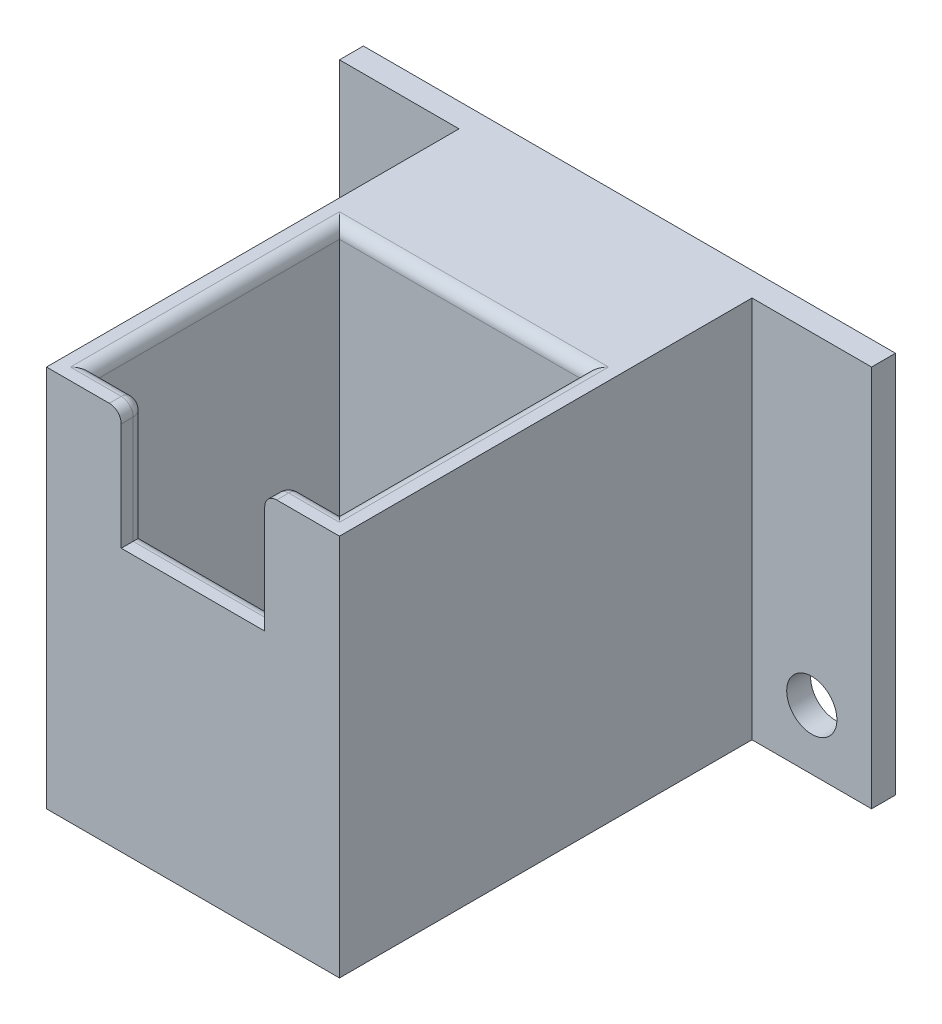
ISO-10303-21;
HEADER;
FILE_DESCRIPTION(('STEP AP214'),'2;1');
FILE_NAME('part.step','',(''),(''),'','','');
FILE_SCHEMA(('AUTOMOTIVE_DESIGN { 1 0 10303 214 1 1 1 1 }'));
ENDSEC;
DATA;
#1=APPLICATION_CONTEXT('core data for automotive mechanical design processes');
#2=APPLICATION_PROTOCOL_DEFINITION('international standard','automotive_design',2000,#1);
#3=PRODUCT_CONTEXT('',#1,'mechanical');
#4=PRODUCT('Part','Part','',(#3));
#5=PRODUCT_RELATED_PRODUCT_CATEGORY('part','',(#4));
#6=PRODUCT_DEFINITION_FORMATION('','',#4);
#7=PRODUCT_DEFINITION_CONTEXT('part definition',#1,'design');
#8=PRODUCT_DEFINITION('design','',#6,#7);
#9=PRODUCT_DEFINITION_SHAPE('','',#8);
#10=(LENGTH_UNIT() NAMED_UNIT(*) SI_UNIT(.MILLI.,.METRE.));
#11=(NAMED_UNIT(*) PLANE_ANGLE_UNIT() SI_UNIT($,.RADIAN.));
#12=(NAMED_UNIT(*) SI_UNIT($,.STERADIAN.) SOLID_ANGLE_UNIT());
#13=UNCERTAINTY_MEASURE_WITH_UNIT(LENGTH_MEASURE(1.E-05),#10,'distance_accuracy_value','');
#14=(GEOMETRIC_REPRESENTATION_CONTEXT(3) GLOBAL_UNCERTAINTY_ASSIGNED_CONTEXT((#13)) GLOBAL_UNIT_ASSIGNED_CONTEXT((#10,
#11,#12)) REPRESENTATION_CONTEXT('',''));
#15=CARTESIAN_POINT('',(0.,0.,0.));
#16=DIRECTION('',(0.,0.,1.));
#17=DIRECTION('',(1.,0.,0.));
#18=AXIS2_PLACEMENT_3D('',#15,#16,#17);
#19=CARTESIAN_POINT('',(2.,32.,-22.5));
#20=DIRECTION('',(1.,0.,0.));
#21=DIRECTION('',(0.,0.,-1.));
#22=AXIS2_PLACEMENT_3D('',#19,#20,#21);
#23=PLANE('',#22);
#24=DIRECTION('',(0.,-1.,0.));
#25=VECTOR('',#24,1.);
#26=CARTESIAN_POINT('',(2.,32.,-22.5));
#27=LINE('',#26,#25);
#28=CARTESIAN_POINT('',(2.,31.,-22.5));
#29=VERTEX_POINT('',#28);
#30=CARTESIAN_POINT('',(2.,2.,-22.5));
#31=VERTEX_POINT('',#30);
#32=EDGE_CURVE('E253',#29,#31,#27,.T.);
#33=ORIENTED_EDGE('',*,*,#32,.F.);
#34=DIRECTION('',(0.,0.,1.));
#35=VECTOR('',#34,1.);
#36=CARTESIAN_POINT('',(2.,31.,-22.5));
#37=LINE('',#36,#35);
#38=CARTESIAN_POINT('',(2.,31.,-2.));
#39=VERTEX_POINT('',#38);
#40=EDGE_CURVE('E358',#29,#39,#37,.T.);
#41=ORIENTED_EDGE('',*,*,#40,.T.);
#42=DIRECTION('',(0.,-1.,0.));
#43=VECTOR('',#42,1.);
#44=CARTESIAN_POINT('',(2.,32.,-2.));
#45=LINE('',#44,#43);
#46=CARTESIAN_POINT('',(2.,2.,-2.));
#47=VERTEX_POINT('',#46);
#48=EDGE_CURVE('E259',#39,#47,#45,.T.);
#49=ORIENTED_EDGE('',*,*,#48,.T.);
#50=DIRECTION('',(0.,0.,-1.));
#51=VECTOR('',#50,1.);
#52=CARTESIAN_POINT('',(2.,2.,-2.));
#53=LINE('',#52,#51);
#54=EDGE_CURVE('E239',#47,#31,#53,.T.);
#55=ORIENTED_EDGE('',*,*,#54,.T.);
#56=EDGE_LOOP('',(#33,#41,#49,#55));
#57=FACE_BOUND('',#56,.T.);
#58=ADVANCED_FACE('F33',(#57),#23,.T.);
#59=CARTESIAN_POINT('',(2.,32.,-2.));
#60=DIRECTION('',(0.,0.,-1.));
#61=DIRECTION('',(-1.,0.,0.));
#62=AXIS2_PLACEMENT_3D('',#59,#60,#61);
#63=PLANE('',#62);
#64=ORIENTED_EDGE('',*,*,#48,.F.);
#65=DIRECTION('',(1.,0.,0.));
#66=VECTOR('',#65,1.);
#67=CARTESIAN_POINT('',(2.,31.,-2.));
#68=LINE('',#67,#66);
#69=CARTESIAN_POINT('',(5.25,31.,-2.));
#70=VERTEX_POINT('',#69);
#71=EDGE_CURVE('E331',#39,#70,#68,.T.);
#72=ORIENTED_EDGE('',*,*,#71,.T.);
#73=DIRECTION('',(0.,1.,0.));
#74=VECTOR('',#73,1.);
#75=CARTESIAN_POINT('',(5.25,22.,-2.));
#76=LINE('',#75,#74);
#77=CARTESIAN_POINT('',(5.25,21.,-2.));
#78=VERTEX_POINT('',#77);
#79=EDGE_CURVE('E329',#70,#78,#76,.F.);
#80=ORIENTED_EDGE('',*,*,#79,.T.);
#81=DIRECTION('',(-1.,0.,0.));
#82=VECTOR('',#81,1.);
#83=CARTESIAN_POINT('',(2.,21.,-2.));
#84=LINE('',#83,#82);
#85=CARTESIAN_POINT('',(19.25,21.,-2.));
#86=VERTEX_POINT('',#85);
#87=EDGE_CURVE('E327',#78,#86,#84,.F.);
#88=ORIENTED_EDGE('',*,*,#87,.T.);
#89=DIRECTION('',(0.,1.,0.));
#90=VECTOR('',#89,1.);
#91=CARTESIAN_POINT('',(19.25,32.,-2.));
#92=LINE('',#91,#90);
#93=CARTESIAN_POINT('',(19.25,31.,-2.));
#94=VERTEX_POINT('',#93);
#95=EDGE_CURVE('E324',#86,#94,#92,.T.);
#96=ORIENTED_EDGE('',*,*,#95,.T.);
#97=DIRECTION('',(1.,0.,0.));
#98=VECTOR('',#97,1.);
#99=CARTESIAN_POINT('',(2.,31.,-2.));
#100=LINE('',#99,#98);
#101=CARTESIAN_POINT('',(22.5,31.,-2.));
#102=VERTEX_POINT('',#101);
#103=EDGE_CURVE('E322',#94,#102,#100,.T.);
#104=ORIENTED_EDGE('',*,*,#103,.T.);
#105=DIRECTION('',(0.,-1.,0.));
#106=VECTOR('',#105,1.);
#107=CARTESIAN_POINT('',(22.5,32.,-2.));
#108=LINE('',#107,#106);
#109=CARTESIAN_POINT('',(22.5,2.,-2.));
#110=VERTEX_POINT('',#109);
#111=EDGE_CURVE('E257',#102,#110,#108,.T.);
#112=ORIENTED_EDGE('',*,*,#111,.T.);
#113=DIRECTION('',(-1.,0.,0.));
#114=VECTOR('',#113,1.);
#115=CARTESIAN_POINT('',(2.,2.,-2.));
#116=LINE('',#115,#114);
#117=EDGE_CURVE('E250',#110,#47,#116,.T.);
#118=ORIENTED_EDGE('',*,*,#117,.T.);
#119=EDGE_LOOP('',(#64,#72,#80,#88,#96,#104,#112,#118));
#120=FACE_BOUND('',#119,.T.);
#121=ADVANCED_FACE('F480',(#120),#63,.T.);
#122=CARTESIAN_POINT('',(22.5,32.,-22.5));
#123=DIRECTION('',(-1.,0.,0.));
#124=DIRECTION('',(0.,0.,1.));
#125=AXIS2_PLACEMENT_3D('',#122,#123,#124);
#126=PLANE('',#125);
#127=ORIENTED_EDGE('',*,*,#111,.F.);
#128=DIRECTION('',(0.,0.,-1.));
#129=VECTOR('',#128,1.);
#130=CARTESIAN_POINT('',(22.5,31.,-22.5));
#131=LINE('',#130,#129);
#132=CARTESIAN_POINT('',(22.5,31.,-22.5));
#133=VERTEX_POINT('',#132);
#134=EDGE_CURVE('E58',#102,#133,#131,.T.);
#135=ORIENTED_EDGE('',*,*,#134,.T.);
#136=DIRECTION('',(0.,-1.,0.));
#137=VECTOR('',#136,1.);
#138=CARTESIAN_POINT('',(22.5,32.,-22.5));
#139=LINE('',#138,#137);
#140=CARTESIAN_POINT('',(22.5,2.,-22.5));
#141=VERTEX_POINT('',#140);
#142=EDGE_CURVE('E255',#133,#141,#139,.T.);
#143=ORIENTED_EDGE('',*,*,#142,.T.);
#144=DIRECTION('',(0.,0.,1.));
#145=VECTOR('',#144,1.);
#146=CARTESIAN_POINT('',(22.5,2.,-2.));
#147=LINE('',#146,#145);
#148=EDGE_CURVE('E247',#141,#110,#147,.T.);
#149=ORIENTED_EDGE('',*,*,#148,.T.);
#150=EDGE_LOOP('',(#127,#135,#143,#149));
#151=FACE_BOUND('',#150,.T.);
#152=ADVANCED_FACE('F509',(#151),#126,.T.);
#153=CARTESIAN_POINT('',(2.,32.,-22.5));
#154=DIRECTION('',(0.,0.,1.));
#155=DIRECTION('',(1.,0.,0.));
#156=AXIS2_PLACEMENT_3D('',#153,#154,#155);
#157=PLANE('',#156);
#158=ORIENTED_EDGE('',*,*,#142,.F.);
#159=DIRECTION('',(-1.,0.,0.));
#160=VECTOR('',#159,1.);
#161=CARTESIAN_POINT('',(2.,31.,-22.5));
#162=LINE('',#161,#160);
#163=EDGE_CURVE('E50',#133,#29,#162,.T.);
#164=ORIENTED_EDGE('',*,*,#163,.T.);
#165=ORIENTED_EDGE('',*,*,#32,.T.);
#166=DIRECTION('',(1.,0.,0.));
#167=VECTOR('',#166,1.);
#168=CARTESIAN_POINT('',(2.,2.,-22.5));
#169=LINE('',#168,#167);
#170=EDGE_CURVE('E244',#31,#141,#169,.T.);
#171=ORIENTED_EDGE('',*,*,#170,.T.);
#172=EDGE_LOOP('',(#158,#164,#165,#171));
#173=FACE_BOUND('',#172,.T.);
#174=ADVANCED_FACE('F514',(#173),#157,.T.);
#175=CARTESIAN_POINT('',(0.,32.,0.));
#176=DIRECTION('',(0.,1.,0.));
#177=DIRECTION('',(0.,0.,1.));
#178=AXIS2_PLACEMENT_3D('',#175,#176,#177);
#179=PLANE('',#178);
#180=DIRECTION('',(1.,0.,0.));
#181=VECTOR('',#180,1.);
#182=CARTESIAN_POINT('',(0.,32.,-1.));
#183=LINE('',#182,#181);
#184=CARTESIAN_POINT('',(23.5,32.,-1.));
#185=VERTEX_POINT('',#184);
#186=CARTESIAN_POINT('',(19.25,32.,-1.));
#187=VERTEX_POINT('',#186);
#188=EDGE_CURVE('E352',#185,#187,#183,.F.);
#189=ORIENTED_EDGE('',*,*,#188,.T.);
#190=DIRECTION('',(0.,0.,-1.));
#191=VECTOR('',#190,1.);
#192=CARTESIAN_POINT('',(19.25,32.,0.));
#193=LINE('',#192,#191);
#194=CARTESIAN_POINT('',(19.25,32.,0.));
#195=VERTEX_POINT('',#194);
#196=EDGE_CURVE('E354',#187,#195,#193,.F.);
#197=ORIENTED_EDGE('',*,*,#196,.T.);
#198=DIRECTION('',(1.,0.,0.));
#199=VECTOR('',#198,1.);
#200=CARTESIAN_POINT('',(0.,32.,0.));
#201=LINE('',#200,#199);
#202=CARTESIAN_POINT('',(24.5,32.,0.));
#203=VERTEX_POINT('',#202);
#204=EDGE_CURVE('E265',#195,#203,#201,.T.);
#205=ORIENTED_EDGE('',*,*,#204,.T.);
#206=DIRECTION('',(0.,0.,-1.));
#207=VECTOR('',#206,1.);
#208=CARTESIAN_POINT('',(24.5,32.,0.));
#209=LINE('',#208,#207);
#210=CARTESIAN_POINT('',(24.5,32.,-34.5));
#211=VERTEX_POINT('',#210);
#212=EDGE_CURVE('E270',#203,#211,#209,.T.);
#213=ORIENTED_EDGE('',*,*,#212,.T.);
#214=DIRECTION('',(1.,0.,0.));
#215=VECTOR('',#214,1.);
#216=CARTESIAN_POINT('',(24.5,32.,-34.5));
#217=LINE('',#216,#215);
#218=CARTESIAN_POINT('',(34.5,32.,-34.5));
#219=VERTEX_POINT('',#218);
#220=EDGE_CURVE('E272',#211,#219,#217,.T.);
#221=ORIENTED_EDGE('',*,*,#220,.T.);
#222=DIRECTION('',(0.,0.,-1.));
#223=VECTOR('',#222,1.);
#224=CARTESIAN_POINT('',(34.5,32.,-36.5));
#225=LINE('',#224,#223);
#226=CARTESIAN_POINT('',(34.5,32.,-36.5));
#227=VERTEX_POINT('',#226);
#228=EDGE_CURVE('E274',#219,#227,#225,.T.);
#229=ORIENTED_EDGE('',*,*,#228,.T.);
#230=DIRECTION('',(-1.,0.,0.));
#231=VECTOR('',#230,1.);
#232=CARTESIAN_POINT('',(24.5,32.,-36.5));
#233=LINE('',#232,#231);
#234=CARTESIAN_POINT('',(-10.,32.,-36.5));
#235=VERTEX_POINT('',#234);
#236=EDGE_CURVE('E276',#227,#235,#233,.T.);
#237=ORIENTED_EDGE('',*,*,#236,.T.);
#238=DIRECTION('',(0.,0.,1.));
#239=VECTOR('',#238,1.);
#240=CARTESIAN_POINT('',(-10.,32.,-36.5));
#241=LINE('',#240,#239);
#242=CARTESIAN_POINT('',(-10.,32.,-34.5));
#243=VERTEX_POINT('',#242);
#244=EDGE_CURVE('E278',#235,#243,#241,.T.);
#245=ORIENTED_EDGE('',*,*,#244,.T.);
#246=DIRECTION('',(1.,0.,0.));
#247=VECTOR('',#246,1.);
#248=CARTESIAN_POINT('',(0.,32.,-34.5));
#249=LINE('',#248,#247);
#250=CARTESIAN_POINT('',(0.,32.,-34.5));
#251=VERTEX_POINT('',#250);
#252=EDGE_CURVE('E280',#243,#251,#249,.T.);
#253=ORIENTED_EDGE('',*,*,#252,.T.);
#254=DIRECTION('',(0.,0.,1.));
#255=VECTOR('',#254,1.);
#256=CARTESIAN_POINT('',(0.,32.,0.));
#257=LINE('',#256,#255);
#258=CARTESIAN_POINT('',(0.,32.,0.));
#259=VERTEX_POINT('',#258);
#260=EDGE_CURVE('E262',#251,#259,#257,.T.);
#261=ORIENTED_EDGE('',*,*,#260,.T.);
#262=CARTESIAN_POINT('',(5.25,32.,0.));
#263=VERTEX_POINT('',#262);
#264=EDGE_CURVE('E267',#259,#263,#201,.T.);
#265=ORIENTED_EDGE('',*,*,#264,.T.);
#266=DIRECTION('',(0.,0.,1.));
#267=VECTOR('',#266,1.);
#268=CARTESIAN_POINT('',(5.25,32.,-2.));
#269=LINE('',#268,#267);
#270=CARTESIAN_POINT('',(5.25,32.,-1.));
#271=VERTEX_POINT('',#270);
#272=EDGE_CURVE('E342',#263,#271,#269,.F.);
#273=ORIENTED_EDGE('',*,*,#272,.T.);
#274=DIRECTION('',(1.,0.,0.));
#275=VECTOR('',#274,1.);
#276=CARTESIAN_POINT('',(0.,32.,-1.));
#277=LINE('',#276,#275);
#278=CARTESIAN_POINT('',(1.,32.,-1.));
#279=VERTEX_POINT('',#278);
#280=EDGE_CURVE('E344',#271,#279,#277,.F.);
#281=ORIENTED_EDGE('',*,*,#280,.T.);
#282=DIRECTION('',(0.,0.,1.));
#283=VECTOR('',#282,1.);
#284=CARTESIAN_POINT('',(1.,32.,0.));
#285=LINE('',#284,#283);
#286=CARTESIAN_POINT('',(0.999999999999999,32.,-23.5));
#287=VERTEX_POINT('',#286);
#288=EDGE_CURVE('E346',#279,#287,#285,.F.);
#289=ORIENTED_EDGE('',*,*,#288,.T.);
#290=DIRECTION('',(-1.,0.,0.));
#291=VECTOR('',#290,1.);
#292=CARTESIAN_POINT('',(0.,32.,-23.5));
#293=LINE('',#292,#291);
#294=CARTESIAN_POINT('',(23.5,32.,-23.5));
#295=VERTEX_POINT('',#294);
#296=EDGE_CURVE('E348',#287,#295,#293,.F.);
#297=ORIENTED_EDGE('',*,*,#296,.T.);
#298=DIRECTION('',(0.,0.,-1.));
#299=VECTOR('',#298,1.);
#300=CARTESIAN_POINT('',(23.5,32.,0.));
#301=LINE('',#300,#299);
#302=EDGE_CURVE('E350',#295,#185,#301,.F.);
#303=ORIENTED_EDGE('',*,*,#302,.T.);
#304=EDGE_LOOP('',(#189,#197,#205,#213,#221,#229,#237,#245,#253,#261,#265,#273,#281,#289,#297,#303));
#305=FACE_BOUND('',#304,.T.);
#306=ADVANCED_FACE('F446',(#305),#179,.T.);
#307=CARTESIAN_POINT('',(0.,0.,0.));
#308=DIRECTION('',(0.,1.,0.));
#309=DIRECTION('',(0.,0.,1.));
#310=AXIS2_PLACEMENT_3D('',#307,#308,#309);
#311=PLANE('',#310);
#312=DIRECTION('',(0.,0.,1.));
#313=VECTOR('',#312,1.);
#314=CARTESIAN_POINT('',(0.,0.,0.));
#315=LINE('',#314,#313);
#316=CARTESIAN_POINT('',(0.,0.,-34.5));
#317=VERTEX_POINT('',#316);
#318=CARTESIAN_POINT('',(0.,0.,0.));
#319=VERTEX_POINT('',#318);
#320=EDGE_CURVE('E261',#317,#319,#315,.T.);
#321=ORIENTED_EDGE('',*,*,#320,.F.);
#322=DIRECTION('',(1.,0.,0.));
#323=VECTOR('',#322,1.);
#324=CARTESIAN_POINT('',(0.,0.,-34.5));
#325=LINE('',#324,#323);
#326=CARTESIAN_POINT('',(-10.,0.,-34.5));
#327=VERTEX_POINT('',#326);
#328=EDGE_CURVE('E266',#327,#317,#325,.T.);
#329=ORIENTED_EDGE('',*,*,#328,.F.);
#330=DIRECTION('',(0.,0.,1.));
#331=VECTOR('',#330,1.);
#332=CARTESIAN_POINT('',(-10.,0.,-36.5));
#333=LINE('',#332,#331);
#334=CARTESIAN_POINT('',(-10.,0.,-36.5));
#335=VERTEX_POINT('',#334);
#336=EDGE_CURVE('E296',#335,#327,#333,.T.);
#337=ORIENTED_EDGE('',*,*,#336,.F.);
#338=DIRECTION('',(-1.,0.,0.));
#339=VECTOR('',#338,1.);
#340=CARTESIAN_POINT('',(0.,0.,-36.5));
#341=LINE('',#340,#339);
#342=CARTESIAN_POINT('',(34.5,0.,-36.5));
#343=VERTEX_POINT('',#342);
#344=EDGE_CURVE('E294',#343,#335,#341,.T.);
#345=ORIENTED_EDGE('',*,*,#344,.F.);
#346=DIRECTION('',(0.,0.,-1.));
#347=VECTOR('',#346,1.);
#348=CARTESIAN_POINT('',(34.5,0.,-36.5));
#349=LINE('',#348,#347);
#350=CARTESIAN_POINT('',(34.5,0.,-34.5));
#351=VERTEX_POINT('',#350);
#352=EDGE_CURVE('E291',#351,#343,#349,.T.);
#353=ORIENTED_EDGE('',*,*,#352,.F.);
#354=DIRECTION('',(1.,0.,0.));
#355=VECTOR('',#354,1.);
#356=CARTESIAN_POINT('',(24.5,0.,-34.5));
#357=LINE('',#356,#355);
#358=CARTESIAN_POINT('',(24.5,0.,-34.5));
#359=VERTEX_POINT('',#358);
#360=EDGE_CURVE('E289',#359,#351,#357,.T.);
#361=ORIENTED_EDGE('',*,*,#360,.F.);
#362=DIRECTION('',(0.,0.,-1.));
#363=VECTOR('',#362,1.);
#364=CARTESIAN_POINT('',(24.5,0.,0.));
#365=LINE('',#364,#363);
#366=CARTESIAN_POINT('',(24.5,0.,0.));
#367=VERTEX_POINT('',#366);
#368=EDGE_CURVE('E287',#367,#359,#365,.T.);
#369=ORIENTED_EDGE('',*,*,#368,.F.);
#370=DIRECTION('',(1.,0.,0.));
#371=VECTOR('',#370,1.);
#372=CARTESIAN_POINT('',(0.,0.,0.));
#373=LINE('',#372,#371);
#374=EDGE_CURVE('E285',#319,#367,#373,.T.);
#375=ORIENTED_EDGE('',*,*,#374,.F.);
#376=EDGE_LOOP('',(#321,#329,#337,#345,#353,#361,#369,#375));
#377=FACE_BOUND('',#376,.T.);
#378=CARTESIAN_POINT('',(3.50000000000016,0.,-20.9999999999999));
#379=DIRECTION('',(0.,-1.,0.));
#380=DIRECTION('',(0.,0.,-1.));
#381=AXIS2_PLACEMENT_3D('',#378,#379,#380);
#382=CIRCLE('',#381,1.25);
#383=CARTESIAN_POINT('',(3.50000000000016,0.,-22.2499999999999));
#384=VERTEX_POINT('',#383);
#385=EDGE_CURVE('E208',#384,#384,#382,.T.);
#386=ORIENTED_EDGE('',*,*,#385,.F.);
#387=EDGE_LOOP('',(#386));
#388=FACE_BOUND('',#387,.T.);
#389=CARTESIAN_POINT('',(21.0000000000002,0.,-20.9999999999998));
#390=DIRECTION('',(0.,-1.,0.));
#391=DIRECTION('',(0.,0.,-1.));
#392=AXIS2_PLACEMENT_3D('',#389,#390,#391);
#393=CIRCLE('',#392,1.25);
#394=CARTESIAN_POINT('',(21.0000000000002,0.,-22.2499999999998));
#395=VERTEX_POINT('',#394);
#396=EDGE_CURVE('E216',#395,#395,#393,.T.);
#397=ORIENTED_EDGE('',*,*,#396,.F.);
#398=EDGE_LOOP('',(#397));
#399=FACE_BOUND('',#398,.T.);
#400=CARTESIAN_POINT('',(21.,0.,-3.49999999999979));
#401=DIRECTION('',(0.,-1.,0.));
#402=DIRECTION('',(0.,0.,-1.));
#403=AXIS2_PLACEMENT_3D('',#400,#401,#402);
#404=CIRCLE('',#403,1.25);
#405=CARTESIAN_POINT('',(21.,0.,-4.74999999999979));
#406=VERTEX_POINT('',#405);
#407=EDGE_CURVE('E221',#406,#406,#404,.T.);
#408=ORIENTED_EDGE('',*,*,#407,.F.);
#409=EDGE_LOOP('',(#408));
#410=FACE_BOUND('',#409,.T.);
#411=CARTESIAN_POINT('',(3.5,0.,-3.5));
#412=DIRECTION('',(0.,-1.,0.));
#413=DIRECTION('',(0.,0.,-1.));
#414=AXIS2_PLACEMENT_3D('',#411,#412,#413);
#415=CIRCLE('',#414,1.25);
#416=CARTESIAN_POINT('',(3.5,0.,-4.75));
#417=VERTEX_POINT('',#416);
#418=EDGE_CURVE('E227',#417,#417,#415,.T.);
#419=ORIENTED_EDGE('',*,*,#418,.F.);
#420=EDGE_LOOP('',(#419));
#421=FACE_BOUND('',#420,.T.);
#422=CARTESIAN_POINT('',(12.25,0.,-12.25));
#423=DIRECTION('',(0.,-1.,0.));
#424=DIRECTION('',(0.,0.,-1.));
#425=AXIS2_PLACEMENT_3D('',#422,#423,#424);
#426=CIRCLE('',#425,8.);
#427=CARTESIAN_POINT('',(12.25,0.,-20.25));
#428=VERTEX_POINT('',#427);
#429=EDGE_CURVE('E233',#428,#428,#426,.T.);
#430=ORIENTED_EDGE('',*,*,#429,.F.);
#431=EDGE_LOOP('',(#430));
#432=FACE_BOUND('',#431,.T.);
#433=ADVANCED_FACE('F435',(#377,#388,#399,#410,#421,#432),#311,.F.);
#434=CARTESIAN_POINT('',(0.,32.,0.));
#435=DIRECTION('',(1.,0.,0.));
#436=DIRECTION('',(0.,0.,-1.));
#437=AXIS2_PLACEMENT_3D('',#434,#435,#436);
#438=PLANE('',#437);
#439=ORIENTED_EDGE('',*,*,#320,.T.);
#440=DIRECTION('',(0.,-1.,0.));
#441=VECTOR('',#440,1.);
#442=CARTESIAN_POINT('',(0.,32.,0.));
#443=LINE('',#442,#441);
#444=EDGE_CURVE('E319',#259,#319,#443,.T.);
#445=ORIENTED_EDGE('',*,*,#444,.F.);
#446=ORIENTED_EDGE('',*,*,#260,.F.);
#447=DIRECTION('',(0.,-1.,0.));
#448=VECTOR('',#447,1.);
#449=CARTESIAN_POINT('',(0.,32.,-34.5));
#450=LINE('',#449,#448);
#451=EDGE_CURVE('E282',#251,#317,#450,.T.);
#452=ORIENTED_EDGE('',*,*,#451,.T.);
#453=EDGE_LOOP('',(#439,#445,#446,#452));
#454=FACE_BOUND('',#453,.T.);
#455=ADVANCED_FACE('F443',(#454),#438,.F.);
#456=CARTESIAN_POINT('',(0.,32.,0.));
#457=DIRECTION('',(0.,0.,-1.));
#458=DIRECTION('',(-1.,0.,0.));
#459=AXIS2_PLACEMENT_3D('',#456,#457,#458);
#460=PLANE('',#459);
#461=ORIENTED_EDGE('',*,*,#204,.F.);
#462=CARTESIAN_POINT('',(19.25,31.,0.));
#463=DIRECTION('',(0.,0.,-1.));
#464=DIRECTION('',(-1.,0.,0.));
#465=AXIS2_PLACEMENT_3D('',#462,#463,#464);
#466=CIRCLE('',#465,1.);
#467=CARTESIAN_POINT('',(18.25,31.,0.));
#468=VERTEX_POINT('',#467);
#469=EDGE_CURVE('E11',#195,#468,#466,.F.);
#470=ORIENTED_EDGE('',*,*,#469,.T.);
#471=DIRECTION('',(0.,1.,0.));
#472=VECTOR('',#471,1.);
#473=CARTESIAN_POINT('',(18.25,22.,0.));
#474=LINE('',#473,#472);
#475=CARTESIAN_POINT('',(18.25,22.,0.));
#476=VERTEX_POINT('',#475);
#477=EDGE_CURVE('E189',#476,#468,#474,.T.);
#478=ORIENTED_EDGE('',*,*,#477,.F.);
#479=DIRECTION('',(1.,0.,0.));
#480=VECTOR('',#479,1.);
#481=CARTESIAN_POINT('',(6.25,22.,0.));
#482=LINE('',#481,#480);
#483=CARTESIAN_POINT('',(6.25,22.,0.));
#484=VERTEX_POINT('',#483);
#485=EDGE_CURVE('E195',#484,#476,#482,.T.);
#486=ORIENTED_EDGE('',*,*,#485,.F.);
#487=DIRECTION('',(0.,1.,0.));
#488=VECTOR('',#487,1.);
#489=CARTESIAN_POINT('',(6.25,22.,0.));
#490=LINE('',#489,#488);
#491=CARTESIAN_POINT('',(6.25,31.,0.));
#492=VERTEX_POINT('',#491);
#493=EDGE_CURVE('E194',#484,#492,#490,.T.);
#494=ORIENTED_EDGE('',*,*,#493,.T.);
#495=CARTESIAN_POINT('',(5.25,31.,0.));
#496=DIRECTION('',(0.,0.,-1.));
#497=DIRECTION('',(-1.,0.,0.));
#498=AXIS2_PLACEMENT_3D('',#495,#496,#497);
#499=CIRCLE('',#498,1.);
#500=EDGE_CURVE('E42',#492,#263,#499,.F.);
#501=ORIENTED_EDGE('',*,*,#500,.T.);
#502=ORIENTED_EDGE('',*,*,#264,.F.);
#503=ORIENTED_EDGE('',*,*,#444,.T.);
#504=ORIENTED_EDGE('',*,*,#374,.T.);
#505=DIRECTION('',(0.,-1.,0.));
#506=VECTOR('',#505,1.);
#507=CARTESIAN_POINT('',(24.5,32.,0.));
#508=LINE('',#507,#506);
#509=EDGE_CURVE('E316',#203,#367,#508,.T.);
#510=ORIENTED_EDGE('',*,*,#509,.F.);
#511=EDGE_LOOP('',(#461,#470,#478,#486,#494,#501,#502,#503,#504,#510));
#512=FACE_BOUND('',#511,.T.);
#513=ADVANCED_FACE('F206',(#512),#460,.F.);
#514=CARTESIAN_POINT('',(24.5,32.,0.));
#515=DIRECTION('',(-1.,0.,0.));
#516=DIRECTION('',(0.,0.,1.));
#517=AXIS2_PLACEMENT_3D('',#514,#515,#516);
#518=PLANE('',#517);
#519=ORIENTED_EDGE('',*,*,#368,.T.);
#520=DIRECTION('',(0.,-1.,0.));
#521=VECTOR('',#520,1.);
#522=CARTESIAN_POINT('',(24.5,32.,-34.5));
#523=LINE('',#522,#521);
#524=EDGE_CURVE('E313',#211,#359,#523,.T.);
#525=ORIENTED_EDGE('',*,*,#524,.F.);
#526=ORIENTED_EDGE('',*,*,#212,.F.);
#527=ORIENTED_EDGE('',*,*,#509,.T.);
#528=EDGE_LOOP('',(#519,#525,#526,#527));
#529=FACE_BOUND('',#528,.T.);
#530=ADVANCED_FACE('F459',(#529),#518,.F.);
#531=CARTESIAN_POINT('',(24.5,32.,-34.5));
#532=DIRECTION('',(0.,0.,-1.));
#533=DIRECTION('',(-1.,0.,0.));
#534=AXIS2_PLACEMENT_3D('',#531,#532,#533);
#535=PLANE('',#534);
#536=CARTESIAN_POINT('',(29.5,5.,-34.5));
#537=DIRECTION('',(0.,0.,-1.));
#538=DIRECTION('',(-1.,0.,0.));
#539=AXIS2_PLACEMENT_3D('',#536,#537,#538);
#540=CIRCLE('',#539,2.1);
#541=CARTESIAN_POINT('',(27.4,5.,-34.5));
#542=VERTEX_POINT('',#541);
#543=EDGE_CURVE('E364',#542,#542,#540,.F.);
#544=ORIENTED_EDGE('',*,*,#543,.F.);
#545=EDGE_LOOP('',(#544));
#546=FACE_BOUND('',#545,.T.);
#547=ORIENTED_EDGE('',*,*,#360,.T.);
#548=DIRECTION('',(0.,-1.,0.));
#549=VECTOR('',#548,1.);
#550=CARTESIAN_POINT('',(34.5,32.,-34.5));
#551=LINE('',#550,#549);
#552=EDGE_CURVE('E310',#219,#351,#551,.T.);
#553=ORIENTED_EDGE('',*,*,#552,.F.);
#554=ORIENTED_EDGE('',*,*,#220,.F.);
#555=ORIENTED_EDGE('',*,*,#524,.T.);
#556=EDGE_LOOP('',(#547,#553,#554,#555));
#557=FACE_BOUND('',#556,.T.);
#558=ADVANCED_FACE('F455',(#546,#557),#535,.F.);
#559=CARTESIAN_POINT('',(34.5,32.,-36.5));
#560=DIRECTION('',(-1.,0.,0.));
#561=DIRECTION('',(0.,0.,1.));
#562=AXIS2_PLACEMENT_3D('',#559,#560,#561);
#563=PLANE('',#562);
#564=ORIENTED_EDGE('',*,*,#352,.T.);
#565=DIRECTION('',(0.,-1.,0.));
#566=VECTOR('',#565,1.);
#567=CARTESIAN_POINT('',(34.5,32.,-36.5));
#568=LINE('',#567,#566);
#569=EDGE_CURVE('E307',#227,#343,#568,.T.);
#570=ORIENTED_EDGE('',*,*,#569,.F.);
#571=ORIENTED_EDGE('',*,*,#228,.F.);
#572=ORIENTED_EDGE('',*,*,#552,.T.);
#573=EDGE_LOOP('',(#564,#570,#571,#572));
#574=FACE_BOUND('',#573,.T.);
#575=ADVANCED_FACE('F420',(#574),#563,.F.);
#576=CARTESIAN_POINT('',(0.,32.,-36.5));
#577=DIRECTION('',(0.,0.,1.));
#578=DIRECTION('',(1.,0.,0.));
#579=AXIS2_PLACEMENT_3D('',#576,#577,#578);
#580=PLANE('',#579);
#581=CARTESIAN_POINT('',(29.5,5.,-36.5));
#582=DIRECTION('',(0.,0.,-1.));
#583=DIRECTION('',(-1.,0.,0.));
#584=AXIS2_PLACEMENT_3D('',#581,#582,#583);
#585=CIRCLE('',#584,2.1);
#586=CARTESIAN_POINT('',(27.4,5.,-36.5));
#587=VERTEX_POINT('',#586);
#588=EDGE_CURVE('E404',#587,#587,#585,.T.);
#589=ORIENTED_EDGE('',*,*,#588,.F.);
#590=EDGE_LOOP('',(#589));
#591=FACE_BOUND('',#590,.T.);
#592=CARTESIAN_POINT('',(-5.,5.,-36.5));
#593=DIRECTION('',(0.,0.,-1.));
#594=DIRECTION('',(1.,0.,0.));
#595=AXIS2_PLACEMENT_3D('',#592,#593,#594);
#596=CIRCLE('',#595,2.1);
#597=CARTESIAN_POINT('',(-2.9,5.,-36.5));
#598=VERTEX_POINT('',#597);
#599=EDGE_CURVE('E405',#598,#598,#596,.T.);
#600=ORIENTED_EDGE('',*,*,#599,.F.);
#601=EDGE_LOOP('',(#600));
#602=FACE_BOUND('',#601,.T.);
#603=ORIENTED_EDGE('',*,*,#344,.T.);
#604=DIRECTION('',(0.,-1.,0.));
#605=VECTOR('',#604,1.);
#606=CARTESIAN_POINT('',(-10.,32.,-36.5));
#607=LINE('',#606,#605);
#608=EDGE_CURVE('E304',#235,#335,#607,.T.);
#609=ORIENTED_EDGE('',*,*,#608,.F.);
#610=ORIENTED_EDGE('',*,*,#236,.F.);
#611=ORIENTED_EDGE('',*,*,#569,.T.);
#612=EDGE_LOOP('',(#603,#609,#610,#611));
#613=FACE_BOUND('',#612,.T.);
#614=ADVANCED_FACE('F416',(#591,#602,#613),#580,.F.);
#615=CARTESIAN_POINT('',(-10.,32.,-36.5));
#616=DIRECTION('',(1.,0.,0.));
#617=DIRECTION('',(0.,0.,-1.));
#618=AXIS2_PLACEMENT_3D('',#615,#616,#617);
#619=PLANE('',#618);
#620=ORIENTED_EDGE('',*,*,#336,.T.);
#621=DIRECTION('',(0.,-1.,0.));
#622=VECTOR('',#621,1.);
#623=CARTESIAN_POINT('',(-10.,32.,-34.5));
#624=LINE('',#623,#622);
#625=EDGE_CURVE('E301',#243,#327,#624,.T.);
#626=ORIENTED_EDGE('',*,*,#625,.F.);
#627=ORIENTED_EDGE('',*,*,#244,.F.);
#628=ORIENTED_EDGE('',*,*,#608,.T.);
#629=EDGE_LOOP('',(#620,#626,#627,#628));
#630=FACE_BOUND('',#629,.T.);
#631=ADVANCED_FACE('F419',(#630),#619,.F.);
#632=CARTESIAN_POINT('',(0.,32.,-34.5));
#633=DIRECTION('',(0.,0.,-1.));
#634=DIRECTION('',(-1.,0.,0.));
#635=AXIS2_PLACEMENT_3D('',#632,#633,#634);
#636=PLANE('',#635);
#637=CARTESIAN_POINT('',(-5.,5.,-34.5));
#638=DIRECTION('',(0.,0.,-1.));
#639=DIRECTION('',(-1.,0.,0.));
#640=AXIS2_PLACEMENT_3D('',#637,#638,#639);
#641=CIRCLE('',#640,2.1);
#642=CARTESIAN_POINT('',(-7.1,5.,-34.5));
#643=VERTEX_POINT('',#642);
#644=EDGE_CURVE('E401',#643,#643,#641,.F.);
#645=ORIENTED_EDGE('',*,*,#644,.F.);
#646=EDGE_LOOP('',(#645));
#647=FACE_BOUND('',#646,.T.);
#648=ORIENTED_EDGE('',*,*,#328,.T.);
#649=ORIENTED_EDGE('',*,*,#451,.F.);
#650=ORIENTED_EDGE('',*,*,#252,.F.);
#651=ORIENTED_EDGE('',*,*,#625,.T.);
#652=EDGE_LOOP('',(#648,#649,#650,#651));
#653=FACE_BOUND('',#652,.T.);
#654=ADVANCED_FACE('F439',(#647,#653),#636,.F.);
#655=CARTESIAN_POINT('',(0.,2.,0.));
#656=DIRECTION('',(0.,-1.,0.));
#657=DIRECTION('',(0.,0.,-1.));
#658=AXIS2_PLACEMENT_3D('',#655,#656,#657);
#659=PLANE('',#658);
#660=CARTESIAN_POINT('',(3.50000000000016,2.,-20.9999999999999));
#661=DIRECTION('',(0.,-1.,0.));
#662=DIRECTION('',(0.,0.,-1.));
#663=AXIS2_PLACEMENT_3D('',#660,#661,#662);
#664=CIRCLE('',#663,1.25);
#665=CARTESIAN_POINT('',(3.50000000000016,2.,-22.2499999999999));
#666=VERTEX_POINT('',#665);
#667=EDGE_CURVE('E211',#666,#666,#664,.T.);
#668=ORIENTED_EDGE('',*,*,#667,.T.);
#669=EDGE_LOOP('',(#668));
#670=FACE_BOUND('',#669,.T.);
#671=CARTESIAN_POINT('',(21.0000000000002,2.,-20.9999999999998));
#672=DIRECTION('',(0.,-1.,0.));
#673=DIRECTION('',(0.,0.,-1.));
#674=AXIS2_PLACEMENT_3D('',#671,#672,#673);
#675=CIRCLE('',#674,1.25);
#676=CARTESIAN_POINT('',(21.0000000000002,2.,-22.2499999999998));
#677=VERTEX_POINT('',#676);
#678=EDGE_CURVE('E218',#677,#677,#675,.T.);
#679=ORIENTED_EDGE('',*,*,#678,.T.);
#680=EDGE_LOOP('',(#679));
#681=FACE_BOUND('',#680,.T.);
#682=CARTESIAN_POINT('',(21.,2.,-3.49999999999979));
#683=DIRECTION('',(0.,-1.,0.));
#684=DIRECTION('',(0.,0.,-1.));
#685=AXIS2_PLACEMENT_3D('',#682,#683,#684);
#686=CIRCLE('',#685,1.25);
#687=CARTESIAN_POINT('',(21.,2.,-4.74999999999979));
#688=VERTEX_POINT('',#687);
#689=EDGE_CURVE('E224',#688,#688,#686,.T.);
#690=ORIENTED_EDGE('',*,*,#689,.T.);
#691=EDGE_LOOP('',(#690));
#692=FACE_BOUND('',#691,.T.);
#693=CARTESIAN_POINT('',(3.5,2.,-3.5));
#694=DIRECTION('',(0.,-1.,0.));
#695=DIRECTION('',(0.,0.,-1.));
#696=AXIS2_PLACEMENT_3D('',#693,#694,#695);
#697=CIRCLE('',#696,1.25);
#698=CARTESIAN_POINT('',(3.5,2.,-4.75));
#699=VERTEX_POINT('',#698);
#700=EDGE_CURVE('E230',#699,#699,#697,.T.);
#701=ORIENTED_EDGE('',*,*,#700,.T.);
#702=EDGE_LOOP('',(#701));
#703=FACE_BOUND('',#702,.T.);
#704=CARTESIAN_POINT('',(12.25,2.,-12.25));
#705=DIRECTION('',(0.,-1.,0.));
#706=DIRECTION('',(0.,0.,-1.));
#707=AXIS2_PLACEMENT_3D('',#704,#705,#706);
#708=CIRCLE('',#707,8.);
#709=CARTESIAN_POINT('',(12.25,2.,-20.25));
#710=VERTEX_POINT('',#709);
#711=EDGE_CURVE('E236',#710,#710,#708,.T.);
#712=ORIENTED_EDGE('',*,*,#711,.T.);
#713=EDGE_LOOP('',(#712));
#714=FACE_BOUND('',#713,.T.);
#715=ORIENTED_EDGE('',*,*,#54,.F.);
#716=ORIENTED_EDGE('',*,*,#117,.F.);
#717=ORIENTED_EDGE('',*,*,#148,.F.);
#718=ORIENTED_EDGE('',*,*,#170,.F.);
#719=EDGE_LOOP('',(#715,#716,#717,#718));
#720=FACE_BOUND('',#719,.T.);
#721=ADVANCED_FACE('F513',(#670,#681,#692,#703,#714,#720),#659,.F.);
#722=CARTESIAN_POINT('',(12.25,2.,-12.25));
#723=DIRECTION('',(0.,-1.,0.));
#724=DIRECTION('',(0.,0.,-1.));
#725=AXIS2_PLACEMENT_3D('',#722,#723,#724);
#726=CYLINDRICAL_SURFACE('',#725,8.);
#727=ORIENTED_EDGE('',*,*,#711,.F.);
#728=EDGE_LOOP('',(#727));
#729=FACE_BOUND('',#728,.T.);
#730=ORIENTED_EDGE('',*,*,#429,.T.);
#731=EDGE_LOOP('',(#730));
#732=FACE_BOUND('',#731,.T.);
#733=ADVANCED_FACE('F599',(#729,#732),#726,.F.);
#734=CARTESIAN_POINT('',(3.5,2.,-3.5));
#735=DIRECTION('',(0.,-1.,0.));
#736=DIRECTION('',(0.,0.,-1.));
#737=AXIS2_PLACEMENT_3D('',#734,#735,#736);
#738=CYLINDRICAL_SURFACE('',#737,1.25);
#739=ORIENTED_EDGE('',*,*,#700,.F.);
#740=EDGE_LOOP('',(#739));
#741=FACE_BOUND('',#740,.T.);
#742=ORIENTED_EDGE('',*,*,#418,.T.);
#743=EDGE_LOOP('',(#742));
#744=FACE_BOUND('',#743,.T.);
#745=ADVANCED_FACE('F595',(#741,#744),#738,.F.);
#746=CARTESIAN_POINT('',(21.,2.,-3.49999999999979));
#747=DIRECTION('',(0.,-1.,0.));
#748=DIRECTION('',(0.,0.,-1.));
#749=AXIS2_PLACEMENT_3D('',#746,#747,#748);
#750=CYLINDRICAL_SURFACE('',#749,1.25);
#751=ORIENTED_EDGE('',*,*,#689,.F.);
#752=EDGE_LOOP('',(#751));
#753=FACE_BOUND('',#752,.T.);
#754=ORIENTED_EDGE('',*,*,#407,.T.);
#755=EDGE_LOOP('',(#754));
#756=FACE_BOUND('',#755,.T.);
#757=ADVANCED_FACE('F591',(#753,#756),#750,.F.);
#758=CARTESIAN_POINT('',(21.0000000000002,2.,-20.9999999999998));
#759=DIRECTION('',(0.,-1.,0.));
#760=DIRECTION('',(0.,0.,-1.));
#761=AXIS2_PLACEMENT_3D('',#758,#759,#760);
#762=CYLINDRICAL_SURFACE('',#761,1.25);
#763=ORIENTED_EDGE('',*,*,#678,.F.);
#764=EDGE_LOOP('',(#763));
#765=FACE_BOUND('',#764,.T.);
#766=ORIENTED_EDGE('',*,*,#396,.T.);
#767=EDGE_LOOP('',(#766));
#768=FACE_BOUND('',#767,.T.);
#769=ADVANCED_FACE('F587',(#765,#768),#762,.F.);
#770=CARTESIAN_POINT('',(3.50000000000016,2.,-20.9999999999999));
#771=DIRECTION('',(0.,-1.,0.));
#772=DIRECTION('',(0.,0.,-1.));
#773=AXIS2_PLACEMENT_3D('',#770,#771,#772);
#774=CYLINDRICAL_SURFACE('',#773,1.25);
#775=ORIENTED_EDGE('',*,*,#667,.F.);
#776=EDGE_LOOP('',(#775));
#777=FACE_BOUND('',#776,.T.);
#778=ORIENTED_EDGE('',*,*,#385,.T.);
#779=EDGE_LOOP('',(#778));
#780=FACE_BOUND('',#779,.T.);
#781=ADVANCED_FACE('F583',(#777,#780),#774,.F.);
#782=CARTESIAN_POINT('',(6.25,22.,-2.));
#783=DIRECTION('',(-1.,0.,0.));
#784=DIRECTION('',(0.,0.,1.));
#785=AXIS2_PLACEMENT_3D('',#782,#783,#784);
#786=PLANE('',#785);
#787=DIRECTION('',(0.,0.,1.));
#788=VECTOR('',#787,1.);
#789=CARTESIAN_POINT('',(6.25,22.,-2.));
#790=LINE('',#789,#788);
#791=CARTESIAN_POINT('',(6.25,22.,-1.));
#792=VERTEX_POINT('',#791);
#793=EDGE_CURVE('E200',#792,#484,#790,.T.);
#794=ORIENTED_EDGE('',*,*,#793,.F.);
#795=DIRECTION('',(0.,1.,0.));
#796=VECTOR('',#795,1.);
#797=CARTESIAN_POINT('',(6.25,32.,-1.));
#798=LINE('',#797,#796);
#799=CARTESIAN_POINT('',(6.25,31.,-1.));
#800=VERTEX_POINT('',#799);
#801=EDGE_CURVE('E340',#792,#800,#798,.T.);
#802=ORIENTED_EDGE('',*,*,#801,.T.);
#803=DIRECTION('',(0.,0.,1.));
#804=VECTOR('',#803,1.);
#805=CARTESIAN_POINT('',(6.25,31.,0.));
#806=LINE('',#805,#804);
#807=EDGE_CURVE('E338',#800,#492,#806,.T.);
#808=ORIENTED_EDGE('',*,*,#807,.T.);
#809=ORIENTED_EDGE('',*,*,#493,.F.);
#810=EDGE_LOOP('',(#794,#802,#808,#809));
#811=FACE_BOUND('',#810,.T.);
#812=ADVANCED_FACE('F576',(#811),#786,.F.);
#813=CARTESIAN_POINT('',(18.25,22.,-2.));
#814=DIRECTION('',(1.,0.,0.));
#815=DIRECTION('',(0.,0.,-1.));
#816=AXIS2_PLACEMENT_3D('',#813,#814,#815);
#817=PLANE('',#816);
#818=DIRECTION('',(0.,0.,-1.));
#819=VECTOR('',#818,1.);
#820=CARTESIAN_POINT('',(18.25,31.,-2.));
#821=LINE('',#820,#819);
#822=CARTESIAN_POINT('',(18.25,31.,-1.));
#823=VERTEX_POINT('',#822);
#824=EDGE_CURVE('E333',#468,#823,#821,.T.);
#825=ORIENTED_EDGE('',*,*,#824,.T.);
#826=DIRECTION('',(0.,1.,0.));
#827=VECTOR('',#826,1.);
#828=CARTESIAN_POINT('',(18.25,22.,-1.));
#829=LINE('',#828,#827);
#830=CARTESIAN_POINT('',(18.25,22.,-1.));
#831=VERTEX_POINT('',#830);
#832=EDGE_CURVE('E192',#823,#831,#829,.F.);
#833=ORIENTED_EDGE('',*,*,#832,.T.);
#834=DIRECTION('',(0.,0.,-1.));
#835=VECTOR('',#834,1.);
#836=CARTESIAN_POINT('',(18.25,22.,-2.));
#837=LINE('',#836,#835);
#838=EDGE_CURVE('E185',#476,#831,#837,.T.);
#839=ORIENTED_EDGE('',*,*,#838,.F.);
#840=ORIENTED_EDGE('',*,*,#477,.T.);
#841=EDGE_LOOP('',(#825,#833,#839,#840));
#842=FACE_BOUND('',#841,.T.);
#843=ADVANCED_FACE('F187',(#842),#817,.F.);
#844=CARTESIAN_POINT('',(0.,22.,0.));
#845=DIRECTION('',(0.,1.,0.));
#846=DIRECTION('',(0.,0.,1.));
#847=AXIS2_PLACEMENT_3D('',#844,#845,#846);
#848=PLANE('',#847);
#849=ORIENTED_EDGE('',*,*,#838,.T.);
#850=DIRECTION('',(-1.,0.,0.));
#851=VECTOR('',#850,1.);
#852=CARTESIAN_POINT('',(0.,22.,-1.));
#853=LINE('',#852,#851);
#854=EDGE_CURVE('E336',#831,#792,#853,.T.);
#855=ORIENTED_EDGE('',*,*,#854,.T.);
#856=ORIENTED_EDGE('',*,*,#793,.T.);
#857=ORIENTED_EDGE('',*,*,#485,.T.);
#858=EDGE_LOOP('',(#849,#855,#856,#857));
#859=FACE_BOUND('',#858,.T.);
#860=ADVANCED_FACE('F198',(#859),#848,.T.);
#861=CARTESIAN_POINT('',(0.999999999999999,31.,-22.5));
#862=DIRECTION('',(0.,0.,1.));
#863=DIRECTION('',(1.,0.,0.));
#864=AXIS2_PLACEMENT_3D('',#861,#862,#863);
#865=CYLINDRICAL_SURFACE('',#864,1.);
#866=CARTESIAN_POINT('',(0.999999999999999,31.,-23.5));
#867=DIRECTION('',(-0.707106781186547,0.,0.707106781186548));
#868=DIRECTION('',(-0.707106781186548,0.,-0.707106781186547));
#869=AXIS2_PLACEMENT_3D('',#866,#867,#868);
#870=ELLIPSE('',#869,1.4142135623731,1.);
#871=EDGE_CURVE('E389',#287,#29,#870,.F.);
#872=ORIENTED_EDGE('',*,*,#871,.F.);
#873=ORIENTED_EDGE('',*,*,#288,.F.);
#874=CARTESIAN_POINT('',(1.,31.,-1.));
#875=DIRECTION('',(0.707106781186548,0.,0.707106781186547));
#876=DIRECTION('',(0.707106781186547,0.,-0.707106781186548));
#877=AXIS2_PLACEMENT_3D('',#874,#875,#876);
#878=ELLIPSE('',#877,1.41421356237309,1.);
#879=EDGE_CURVE('E37',#39,#279,#878,.T.);
#880=ORIENTED_EDGE('',*,*,#879,.F.);
#881=ORIENTED_EDGE('',*,*,#40,.F.);
#882=EDGE_LOOP('',(#872,#873,#880,#881));
#883=FACE_BOUND('',#882,.T.);
#884=ADVANCED_FACE('F35',(#883),#865,.T.);
#885=CARTESIAN_POINT('',(5.25,31.,-2.));
#886=DIRECTION('',(0.,0.,-1.));
#887=DIRECTION('',(-1.,0.,0.));
#888=AXIS2_PLACEMENT_3D('',#885,#886,#887);
#889=CYLINDRICAL_SURFACE('',#888,1.);
#890=ORIENTED_EDGE('',*,*,#500,.F.);
#891=ORIENTED_EDGE('',*,*,#807,.F.);
#892=CARTESIAN_POINT('',(5.25,31.,-1.));
#893=DIRECTION('',(0.,0.,-1.));
#894=DIRECTION('',(-1.,0.,0.));
#895=AXIS2_PLACEMENT_3D('',#892,#893,#894);
#896=CIRCLE('',#895,1.);
#897=EDGE_CURVE('E387',#271,#800,#896,.T.);
#898=ORIENTED_EDGE('',*,*,#897,.F.);
#899=ORIENTED_EDGE('',*,*,#272,.F.);
#900=EDGE_LOOP('',(#890,#891,#898,#899));
#901=FACE_BOUND('',#900,.T.);
#902=ADVANCED_FACE('F464',(#901),#889,.T.);
#903=CARTESIAN_POINT('',(2.,31.,-1.));
#904=DIRECTION('',(1.,0.,0.));
#905=DIRECTION('',(0.,0.,-1.));
#906=AXIS2_PLACEMENT_3D('',#903,#904,#905);
#907=CYLINDRICAL_SURFACE('',#906,1.);
#908=ORIENTED_EDGE('',*,*,#879,.T.);
#909=ORIENTED_EDGE('',*,*,#280,.F.);
#910=CARTESIAN_POINT('',(5.25,31.,-1.));
#911=DIRECTION('',(1.,0.,0.));
#912=DIRECTION('',(0.,0.,-1.));
#913=AXIS2_PLACEMENT_3D('',#910,#911,#912);
#914=CIRCLE('',#913,1.);
#915=EDGE_CURVE('E384',#70,#271,#914,.T.);
#916=ORIENTED_EDGE('',*,*,#915,.F.);
#917=ORIENTED_EDGE('',*,*,#71,.F.);
#918=EDGE_LOOP('',(#908,#909,#916,#917));
#919=FACE_BOUND('',#918,.T.);
#920=ADVANCED_FACE('F468',(#919),#907,.T.);
#921=CARTESIAN_POINT('',(2.,31.,-23.5));
#922=DIRECTION('',(-1.,0.,0.));
#923=DIRECTION('',(0.,0.,1.));
#924=AXIS2_PLACEMENT_3D('',#921,#922,#923);
#925=CYLINDRICAL_SURFACE('',#924,1.);
#926=ORIENTED_EDGE('',*,*,#871,.T.);
#927=ORIENTED_EDGE('',*,*,#163,.F.);
#928=CARTESIAN_POINT('',(23.5,31.,-23.5));
#929=DIRECTION('',(-0.707106781186547,0.,-0.707106781186547));
#930=DIRECTION('',(0.707106781186547,0.,-0.707106781186547));
#931=AXIS2_PLACEMENT_3D('',#928,#929,#930);
#932=ELLIPSE('',#931,1.41421356237309,1.);
#933=EDGE_CURVE('E381',#295,#133,#932,.F.);
#934=ORIENTED_EDGE('',*,*,#933,.F.);
#935=ORIENTED_EDGE('',*,*,#296,.F.);
#936=EDGE_LOOP('',(#926,#927,#934,#935));
#937=FACE_BOUND('',#936,.T.);
#938=ADVANCED_FACE('F490',(#937),#925,.T.);
#939=CARTESIAN_POINT('',(5.25,31.,-1.));
#940=DIRECTION('',(0.,1.,0.));
#941=DIRECTION('',(0.,0.,1.));
#942=AXIS2_PLACEMENT_3D('',#939,#940,#941);
#943=SPHERICAL_SURFACE('',#942,1.);
#944=ORIENTED_EDGE('',*,*,#915,.T.);
#945=ORIENTED_EDGE('',*,*,#897,.T.);
#946=CARTESIAN_POINT('',(5.25,31.,-1.));
#947=DIRECTION('',(0.,1.,0.));
#948=DIRECTION('',(0.,0.,1.));
#949=AXIS2_PLACEMENT_3D('',#946,#947,#948);
#950=CIRCLE('',#949,1.);
#951=EDGE_CURVE('E378',#70,#800,#950,.F.);
#952=ORIENTED_EDGE('',*,*,#951,.F.);
#953=EDGE_LOOP('',(#944,#945,#952));
#954=FACE_BOUND('',#953,.T.);
#955=ADVANCED_FACE('F472',(#954),#943,.T.);
#956=CARTESIAN_POINT('',(23.5,31.,-22.5));
#957=DIRECTION('',(0.,0.,-1.));
#958=DIRECTION('',(-1.,0.,0.));
#959=AXIS2_PLACEMENT_3D('',#956,#957,#958);
#960=CYLINDRICAL_SURFACE('',#959,1.);
#961=ORIENTED_EDGE('',*,*,#933,.T.);
#962=ORIENTED_EDGE('',*,*,#134,.F.);
#963=CARTESIAN_POINT('',(23.5,31.,-1.));
#964=DIRECTION('',(0.707106781186547,0.,-0.707106781186547));
#965=DIRECTION('',(0.707106781186547,0.,0.707106781186547));
#966=AXIS2_PLACEMENT_3D('',#963,#964,#965);
#967=ELLIPSE('',#966,1.41421356237309,1.);
#968=EDGE_CURVE('E375',#185,#102,#967,.F.);
#969=ORIENTED_EDGE('',*,*,#968,.F.);
#970=ORIENTED_EDGE('',*,*,#302,.F.);
#971=EDGE_LOOP('',(#961,#962,#969,#970));
#972=FACE_BOUND('',#971,.T.);
#973=ADVANCED_FACE('F492',(#972),#960,.T.);
#974=CARTESIAN_POINT('',(5.25,22.,-1.));
#975=DIRECTION('',(0.,-1.,0.));
#976=DIRECTION('',(0.,0.,-1.));
#977=AXIS2_PLACEMENT_3D('',#974,#975,#976);
#978=CYLINDRICAL_SURFACE('',#977,1.);
#979=ORIENTED_EDGE('',*,*,#951,.T.);
#980=ORIENTED_EDGE('',*,*,#801,.F.);
#981=CARTESIAN_POINT('',(5.25,21.,-1.));
#982=DIRECTION('',(-0.707106781186547,0.707106781186547,0.));
#983=DIRECTION('',(-0.707106781186547,-0.707106781186547,0.));
#984=AXIS2_PLACEMENT_3D('',#981,#982,#983);
#985=ELLIPSE('',#984,1.41421356237309,1.);
#986=EDGE_CURVE('E372',#78,#792,#985,.F.);
#987=ORIENTED_EDGE('',*,*,#986,.F.);
#988=ORIENTED_EDGE('',*,*,#79,.F.);
#989=EDGE_LOOP('',(#979,#980,#987,#988));
#990=FACE_BOUND('',#989,.T.);
#991=ADVANCED_FACE('F476',(#990),#978,.T.);
#992=CARTESIAN_POINT('',(2.,31.,-1.));
#993=DIRECTION('',(1.,0.,0.));
#994=DIRECTION('',(0.,0.,-1.));
#995=AXIS2_PLACEMENT_3D('',#992,#993,#994);
#996=CYLINDRICAL_SURFACE('',#995,1.);
#997=ORIENTED_EDGE('',*,*,#968,.T.);
#998=ORIENTED_EDGE('',*,*,#103,.F.);
#999=CARTESIAN_POINT('',(19.25,31.,-1.));
#1000=DIRECTION('',(-1.,0.,0.));
#1001=DIRECTION('',(0.,0.,1.));
#1002=AXIS2_PLACEMENT_3D('',#999,#1000,#1001);
#1003=CIRCLE('',#1002,1.);
#1004=EDGE_CURVE('E369',#187,#94,#1003,.T.);
#1005=ORIENTED_EDGE('',*,*,#1004,.F.);
#1006=ORIENTED_EDGE('',*,*,#188,.F.);
#1007=EDGE_LOOP('',(#997,#998,#1005,#1006));
#1008=FACE_BOUND('',#1007,.T.);
#1009=ADVANCED_FACE('F497',(#1008),#996,.T.);
#1010=CARTESIAN_POINT('',(19.25,31.,-2.));
#1011=DIRECTION('',(0.,0.,1.));
#1012=DIRECTION('',(1.,0.,0.));
#1013=AXIS2_PLACEMENT_3D('',#1010,#1011,#1012);
#1014=CYLINDRICAL_SURFACE('',#1013,1.);
#1015=ORIENTED_EDGE('',*,*,#469,.F.);
#1016=ORIENTED_EDGE('',*,*,#196,.F.);
#1017=CARTESIAN_POINT('',(19.25,31.,-1.));
#1018=DIRECTION('',(0.,0.,-1.));
#1019=DIRECTION('',(-1.,0.,0.));
#1020=AXIS2_PLACEMENT_3D('',#1017,#1018,#1019);
#1021=CIRCLE('',#1020,1.);
#1022=EDGE_CURVE('E366',#823,#187,#1021,.T.);
#1023=ORIENTED_EDGE('',*,*,#1022,.F.);
#1024=ORIENTED_EDGE('',*,*,#824,.F.);
#1025=EDGE_LOOP('',(#1015,#1016,#1023,#1024));
#1026=FACE_BOUND('',#1025,.T.);
#1027=ADVANCED_FACE('F501',(#1026),#1014,.T.);
#1028=CARTESIAN_POINT('',(0.,21.,-1.));
#1029=DIRECTION('',(-1.,0.,0.));
#1030=DIRECTION('',(0.,0.,1.));
#1031=AXIS2_PLACEMENT_3D('',#1028,#1029,#1030);
#1032=CYLINDRICAL_SURFACE('',#1031,1.);
#1033=ORIENTED_EDGE('',*,*,#986,.T.);
#1034=ORIENTED_EDGE('',*,*,#854,.F.);
#1035=CARTESIAN_POINT('',(19.25,21.,-1.));
#1036=DIRECTION('',(-0.707106781186547,-0.707106781186547,0.));
#1037=DIRECTION('',(0.707106781186547,-0.707106781186547,0.));
#1038=AXIS2_PLACEMENT_3D('',#1035,#1036,#1037);
#1039=ELLIPSE('',#1038,1.41421356237309,1.);
#1040=EDGE_CURVE('E363',#86,#831,#1039,.F.);
#1041=ORIENTED_EDGE('',*,*,#1040,.F.);
#1042=ORIENTED_EDGE('',*,*,#87,.F.);
#1043=EDGE_LOOP('',(#1033,#1034,#1041,#1042));
#1044=FACE_BOUND('',#1043,.T.);
#1045=ADVANCED_FACE('F548',(#1044),#1032,.T.);
#1046=CARTESIAN_POINT('',(19.25,31.,-1.));
#1047=DIRECTION('',(0.,1.,0.));
#1048=DIRECTION('',(0.,0.,1.));
#1049=AXIS2_PLACEMENT_3D('',#1046,#1047,#1048);
#1050=SPHERICAL_SURFACE('',#1049,1.);
#1051=ORIENTED_EDGE('',*,*,#1022,.T.);
#1052=ORIENTED_EDGE('',*,*,#1004,.T.);
#1053=CARTESIAN_POINT('',(19.25,31.,-1.));
#1054=DIRECTION('',(0.,1.,0.));
#1055=DIRECTION('',(0.,0.,1.));
#1056=AXIS2_PLACEMENT_3D('',#1053,#1054,#1055);
#1057=CIRCLE('',#1056,1.);
#1058=EDGE_CURVE('E361',#823,#94,#1057,.F.);
#1059=ORIENTED_EDGE('',*,*,#1058,.F.);
#1060=EDGE_LOOP('',(#1051,#1052,#1059));
#1061=FACE_BOUND('',#1060,.T.);
#1062=ADVANCED_FACE('F508',(#1061),#1050,.T.);
#1063=CARTESIAN_POINT('',(19.25,32.,-1.));
#1064=DIRECTION('',(0.,-1.,0.));
#1065=DIRECTION('',(0.,0.,-1.));
#1066=AXIS2_PLACEMENT_3D('',#1063,#1064,#1065);
#1067=CYLINDRICAL_SURFACE('',#1066,1.);
#1068=ORIENTED_EDGE('',*,*,#1040,.T.);
#1069=ORIENTED_EDGE('',*,*,#832,.F.);
#1070=ORIENTED_EDGE('',*,*,#1058,.T.);
#1071=ORIENTED_EDGE('',*,*,#95,.F.);
#1072=EDGE_LOOP('',(#1068,#1069,#1070,#1071));
#1073=FACE_BOUND('',#1072,.T.);
#1074=ADVANCED_FACE('F505',(#1073),#1067,.T.);
#1075=CARTESIAN_POINT('',(-5.,5.,0.001000000000001));
#1076=DIRECTION('',(0.,0.,-1.));
#1077=DIRECTION('',(-1.,0.,0.));
#1078=AXIS2_PLACEMENT_3D('',#1075,#1076,#1077);
#1079=CYLINDRICAL_SURFACE('',#1078,2.1);
#1080=ORIENTED_EDGE('',*,*,#599,.T.);
#1081=EDGE_LOOP('',(#1080));
#1082=FACE_BOUND('',#1081,.T.);
#1083=ORIENTED_EDGE('',*,*,#644,.T.);
#1084=EDGE_LOOP('',(#1083));
#1085=FACE_BOUND('',#1084,.T.);
#1086=ADVANCED_FACE('F545',(#1082,#1085),#1079,.F.);
#1087=CARTESIAN_POINT('',(29.5,5.,0.001000000000001));
#1088=DIRECTION('',(0.,0.,-1.));
#1089=DIRECTION('',(-1.,0.,0.));
#1090=AXIS2_PLACEMENT_3D('',#1087,#1088,#1089);
#1091=CYLINDRICAL_SURFACE('',#1090,2.1);
#1092=ORIENTED_EDGE('',*,*,#588,.T.);
#1093=EDGE_LOOP('',(#1092));
#1094=FACE_BOUND('',#1093,.T.);
#1095=ORIENTED_EDGE('',*,*,#543,.T.);
#1096=EDGE_LOOP('',(#1095));
#1097=FACE_BOUND('',#1096,.T.);
#1098=ADVANCED_FACE('F413',(#1094,#1097),#1091,.F.);
#1099=CLOSED_SHELL('',(#58,#121,#152,#174,#306,#433,#455,#513,#530,#558,#575,#614,#631,#654,
#721,#733,#745,#757,#769,#781,#812,#843,#860,#884,#902,#920,#938,#955,#973,#991,#1009,#1027,
#1045,#1062,#1074,#1086,#1098));
#1100=MANIFOLD_SOLID_BREP('B2',#1099);
#1101=ADVANCED_BREP_SHAPE_REPRESENTATION('',(#18,#1100),#14);
#1102=SHAPE_DEFINITION_REPRESENTATION(#9,#1101);
ENDSEC;
END-ISO-10303-21;
